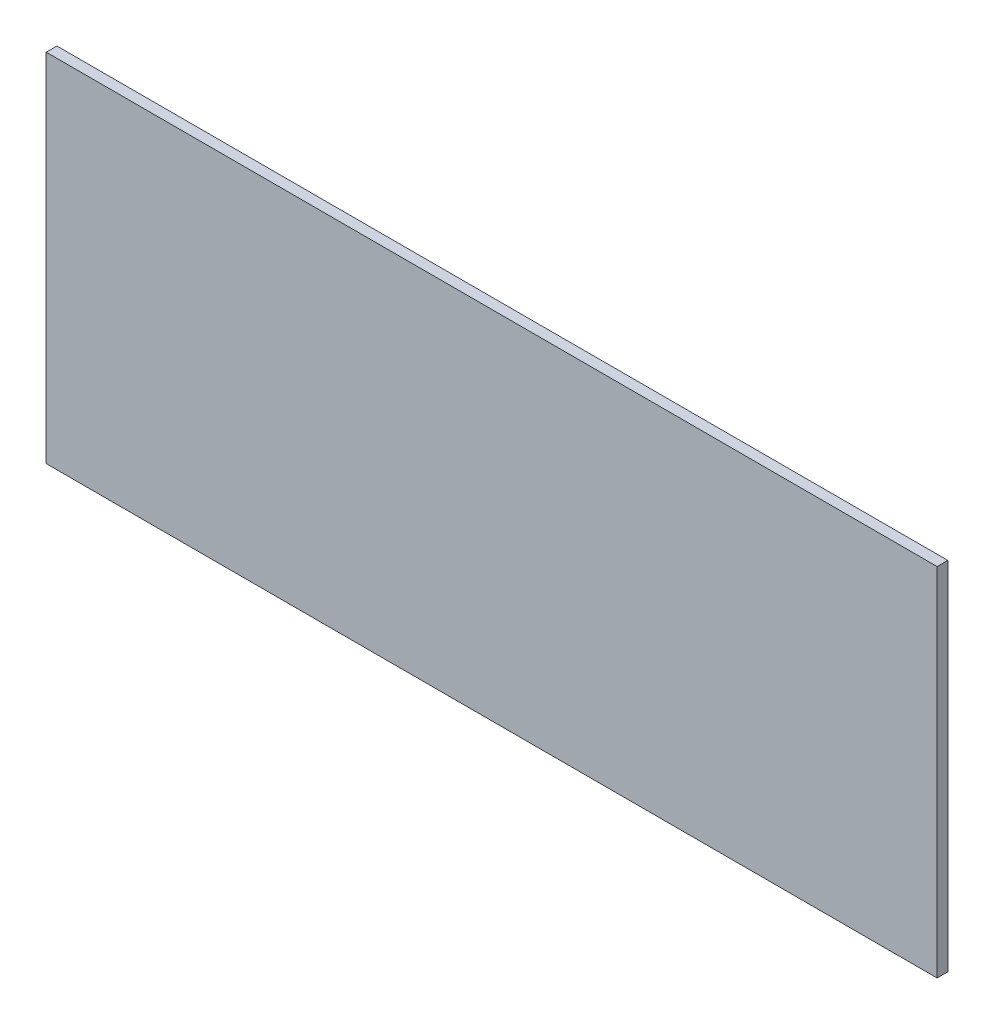
ISO-10303-21;
HEADER;
FILE_DESCRIPTION(('STEP AP214'),'2;1');
FILE_NAME('part.step','',(''),(''),'','','');
FILE_SCHEMA(('AUTOMOTIVE_DESIGN { 1 0 10303 214 1 1 1 1 }'));
ENDSEC;
DATA;
#1=APPLICATION_CONTEXT('core data for automotive mechanical design processes');
#2=APPLICATION_PROTOCOL_DEFINITION('international standard','automotive_design',2000,#1);
#3=PRODUCT_CONTEXT('',#1,'mechanical');
#4=PRODUCT('Part','Part','',(#3));
#5=PRODUCT_RELATED_PRODUCT_CATEGORY('part','',(#4));
#6=PRODUCT_DEFINITION_FORMATION('','',#4);
#7=PRODUCT_DEFINITION_CONTEXT('part definition',#1,'design');
#8=PRODUCT_DEFINITION('design','',#6,#7);
#9=PRODUCT_DEFINITION_SHAPE('','',#8);
#10=(LENGTH_UNIT() NAMED_UNIT(*) SI_UNIT(.MILLI.,.METRE.));
#11=(NAMED_UNIT(*) PLANE_ANGLE_UNIT() SI_UNIT($,.RADIAN.));
#12=(NAMED_UNIT(*) SI_UNIT($,.STERADIAN.) SOLID_ANGLE_UNIT());
#13=UNCERTAINTY_MEASURE_WITH_UNIT(LENGTH_MEASURE(1.E-05),#10,'distance_accuracy_value','');
#14=(GEOMETRIC_REPRESENTATION_CONTEXT(3) GLOBAL_UNCERTAINTY_ASSIGNED_CONTEXT((#13)) GLOBAL_UNIT_ASSIGNED_CONTEXT((#10,
#11,#12)) REPRESENTATION_CONTEXT('',''));
#15=CARTESIAN_POINT('',(0.,0.,0.));
#16=DIRECTION('',(0.,0.,1.));
#17=DIRECTION('',(1.,0.,0.));
#18=AXIS2_PLACEMENT_3D('',#15,#16,#17);
#19=CARTESIAN_POINT('',(0.,0.,-12.));
#20=DIRECTION('',(-1.,0.,0.));
#21=DIRECTION('',(0.,-1.,0.));
#22=AXIS2_PLACEMENT_3D('',#19,#20,#21);
#23=PLANE('',#22);
#24=DIRECTION('',(0.,-1.,0.));
#25=VECTOR('',#24,1.);
#26=CARTESIAN_POINT('',(0.,0.,0.));
#27=LINE('',#26,#25);
#28=CARTESIAN_POINT('',(0.,0.,0.));
#29=VERTEX_POINT('',#28);
#30=CARTESIAN_POINT('',(0.,-400.,0.));
#31=VERTEX_POINT('',#30);
#32=EDGE_CURVE('E102',#29,#31,#27,.T.);
#33=ORIENTED_EDGE('',*,*,#32,.F.);
#34=DIRECTION('',(0.,0.,1.));
#35=VECTOR('',#34,1.);
#36=CARTESIAN_POINT('',(0.,0.,-12.));
#37=LINE('',#36,#35);
#38=CARTESIAN_POINT('',(0.,0.,-12.));
#39=VERTEX_POINT('',#38);
#40=EDGE_CURVE('E11',#39,#29,#37,.T.);
#41=ORIENTED_EDGE('',*,*,#40,.F.);
#42=DIRECTION('',(0.,-1.,0.));
#43=VECTOR('',#42,1.);
#44=CARTESIAN_POINT('',(0.,0.,-12.));
#45=LINE('',#44,#43);
#46=CARTESIAN_POINT('',(0.,-400.,-12.));
#47=VERTEX_POINT('',#46);
#48=EDGE_CURVE('E96',#39,#47,#45,.T.);
#49=ORIENTED_EDGE('',*,*,#48,.T.);
#50=DIRECTION('',(0.,0.,1.));
#51=VECTOR('',#50,1.);
#52=CARTESIAN_POINT('',(0.,-400.,-12.));
#53=LINE('',#52,#51);
#54=EDGE_CURVE('E41',#47,#31,#53,.T.);
#55=ORIENTED_EDGE('',*,*,#54,.T.);
#56=EDGE_LOOP('',(#33,#41,#49,#55));
#57=FACE_BOUND('',#56,.T.);
#58=ADVANCED_FACE('F38',(#57),#23,.T.);
#59=CARTESIAN_POINT('',(0.,0.,-12.));
#60=DIRECTION('',(0.,1.,0.));
#61=DIRECTION('',(0.,0.,1.));
#62=AXIS2_PLACEMENT_3D('',#59,#60,#61);
#63=PLANE('',#62);
#64=DIRECTION('',(-1.,0.,0.));
#65=VECTOR('',#64,1.);
#66=CARTESIAN_POINT('',(0.,0.,0.));
#67=LINE('',#66,#65);
#68=CARTESIAN_POINT('',(1000.,0.,0.));
#69=VERTEX_POINT('',#68);
#70=EDGE_CURVE('E98',#69,#29,#67,.T.);
#71=ORIENTED_EDGE('',*,*,#70,.F.);
#72=DIRECTION('',(0.,0.,1.));
#73=VECTOR('',#72,1.);
#74=CARTESIAN_POINT('',(1000.,0.,-12.));
#75=LINE('',#74,#73);
#76=CARTESIAN_POINT('',(1000.,0.,-12.));
#77=VERTEX_POINT('',#76);
#78=EDGE_CURVE('E47',#77,#69,#75,.T.);
#79=ORIENTED_EDGE('',*,*,#78,.F.);
#80=DIRECTION('',(-1.,0.,0.));
#81=VECTOR('',#80,1.);
#82=CARTESIAN_POINT('',(0.,0.,-12.));
#83=LINE('',#82,#81);
#84=EDGE_CURVE('E93',#77,#39,#83,.T.);
#85=ORIENTED_EDGE('',*,*,#84,.T.);
#86=ORIENTED_EDGE('',*,*,#40,.T.);
#87=EDGE_LOOP('',(#71,#79,#85,#86));
#88=FACE_BOUND('',#87,.T.);
#89=ADVANCED_FACE('F112',(#88),#63,.T.);
#90=CARTESIAN_POINT('',(1000.,0.,-12.));
#91=DIRECTION('',(1.,0.,0.));
#92=DIRECTION('',(0.,0.,-1.));
#93=AXIS2_PLACEMENT_3D('',#90,#91,#92);
#94=PLANE('',#93);
#95=DIRECTION('',(0.,1.,0.));
#96=VECTOR('',#95,1.);
#97=CARTESIAN_POINT('',(1000.,0.,0.));
#98=LINE('',#97,#96);
#99=CARTESIAN_POINT('',(1000.,-400.,0.));
#100=VERTEX_POINT('',#99);
#101=EDGE_CURVE('E88',#100,#69,#98,.T.);
#102=ORIENTED_EDGE('',*,*,#101,.F.);
#103=DIRECTION('',(0.,0.,1.));
#104=VECTOR('',#103,1.);
#105=CARTESIAN_POINT('',(1000.,-400.,-12.));
#106=LINE('',#105,#104);
#107=CARTESIAN_POINT('',(1000.,-400.,-12.));
#108=VERTEX_POINT('',#107);
#109=EDGE_CURVE('E83',#108,#100,#106,.T.);
#110=ORIENTED_EDGE('',*,*,#109,.F.);
#111=DIRECTION('',(0.,1.,0.));
#112=VECTOR('',#111,1.);
#113=CARTESIAN_POINT('',(1000.,0.,-12.));
#114=LINE('',#113,#112);
#115=EDGE_CURVE('E86',#108,#77,#114,.T.);
#116=ORIENTED_EDGE('',*,*,#115,.T.);
#117=ORIENTED_EDGE('',*,*,#78,.T.);
#118=EDGE_LOOP('',(#102,#110,#116,#117));
#119=FACE_BOUND('',#118,.T.);
#120=ADVANCED_FACE('F85',(#119),#94,.T.);
#121=CARTESIAN_POINT('',(0.,-400.,-12.));
#122=DIRECTION('',(0.,-1.,0.));
#123=DIRECTION('',(0.,0.,-1.));
#124=AXIS2_PLACEMENT_3D('',#121,#122,#123);
#125=PLANE('',#124);
#126=DIRECTION('',(1.,0.,0.));
#127=VECTOR('',#126,1.);
#128=CARTESIAN_POINT('',(0.,-400.,0.));
#129=LINE('',#128,#127);
#130=EDGE_CURVE('E105',#31,#100,#129,.T.);
#131=ORIENTED_EDGE('',*,*,#130,.F.);
#132=ORIENTED_EDGE('',*,*,#54,.F.);
#133=DIRECTION('',(1.,0.,0.));
#134=VECTOR('',#133,1.);
#135=CARTESIAN_POINT('',(0.,-400.,-12.));
#136=LINE('',#135,#134);
#137=EDGE_CURVE('E92',#47,#108,#136,.T.);
#138=ORIENTED_EDGE('',*,*,#137,.T.);
#139=ORIENTED_EDGE('',*,*,#109,.T.);
#140=EDGE_LOOP('',(#131,#132,#138,#139));
#141=FACE_BOUND('',#140,.T.);
#142=ADVANCED_FACE('F95',(#141),#125,.T.);
#143=CARTESIAN_POINT('',(0.,0.,-12.));
#144=DIRECTION('',(0.,0.,1.));
#145=DIRECTION('',(1.,0.,0.));
#146=AXIS2_PLACEMENT_3D('',#143,#144,#145);
#147=PLANE('',#146);
#148=ORIENTED_EDGE('',*,*,#48,.F.);
#149=ORIENTED_EDGE('',*,*,#84,.F.);
#150=ORIENTED_EDGE('',*,*,#115,.F.);
#151=ORIENTED_EDGE('',*,*,#137,.F.);
#152=EDGE_LOOP('',(#148,#149,#150,#151));
#153=FACE_BOUND('',#152,.T.);
#154=ADVANCED_FACE('F91',(#153),#147,.F.);
#155=CARTESIAN_POINT('',(0.,0.,0.));
#156=DIRECTION('',(0.,0.,1.));
#157=DIRECTION('',(1.,0.,0.));
#158=AXIS2_PLACEMENT_3D('',#155,#156,#157);
#159=PLANE('',#158);
#160=ORIENTED_EDGE('',*,*,#32,.T.);
#161=ORIENTED_EDGE('',*,*,#130,.T.);
#162=ORIENTED_EDGE('',*,*,#101,.T.);
#163=ORIENTED_EDGE('',*,*,#70,.T.);
#164=EDGE_LOOP('',(#160,#161,#162,#163));
#165=FACE_BOUND('',#164,.T.);
#166=ADVANCED_FACE('F111',(#165),#159,.T.);
#167=CLOSED_SHELL('',(#58,#89,#120,#142,#154,#166));
#168=MANIFOLD_SOLID_BREP('B2',#167);
#169=ADVANCED_BREP_SHAPE_REPRESENTATION('',(#18,#168),#14);
#170=SHAPE_DEFINITION_REPRESENTATION(#9,#169);
ENDSEC;
END-ISO-10303-21;
